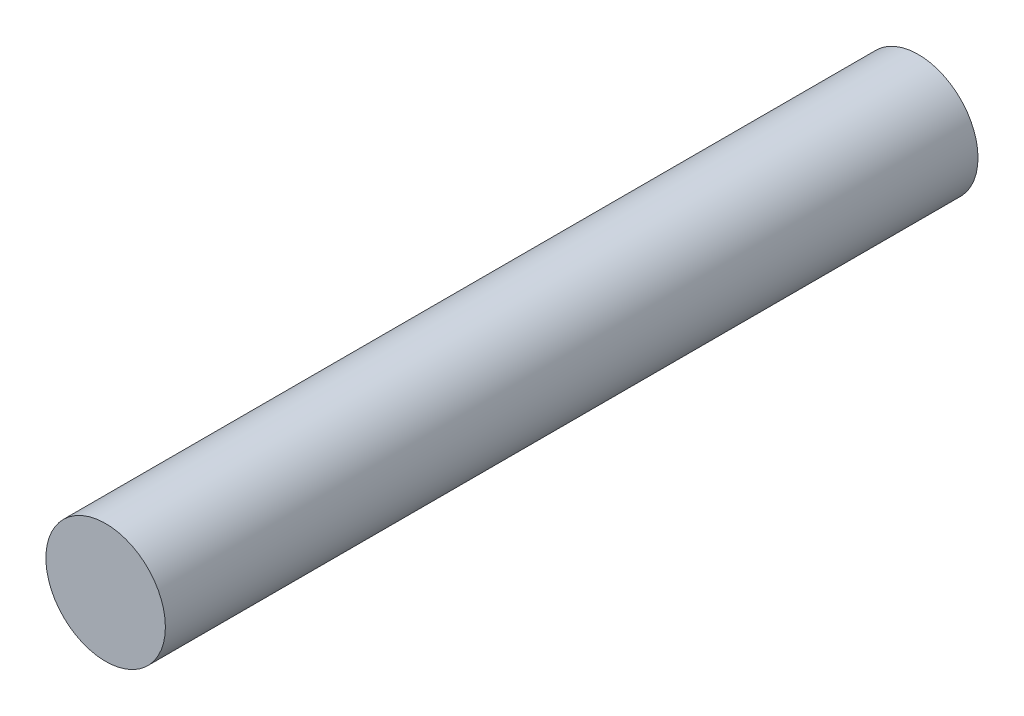
ISO-10303-21;
HEADER;
FILE_DESCRIPTION(('STEP AP214'),'2;1');
FILE_NAME('part.step','',(''),(''),'','','');
FILE_SCHEMA(('AUTOMOTIVE_DESIGN { 1 0 10303 214 1 1 1 1 }'));
ENDSEC;
DATA;
#1=APPLICATION_CONTEXT('core data for automotive mechanical design processes');
#2=APPLICATION_PROTOCOL_DEFINITION('international standard','automotive_design',2000,#1);
#3=PRODUCT_CONTEXT('',#1,'mechanical');
#4=PRODUCT('Part','Part','',(#3));
#5=PRODUCT_RELATED_PRODUCT_CATEGORY('part','',(#4));
#6=PRODUCT_DEFINITION_FORMATION('','',#4);
#7=PRODUCT_DEFINITION_CONTEXT('part definition',#1,'design');
#8=PRODUCT_DEFINITION('design','',#6,#7);
#9=PRODUCT_DEFINITION_SHAPE('','',#8);
#10=(LENGTH_UNIT() NAMED_UNIT(*) SI_UNIT(.MILLI.,.METRE.));
#11=(NAMED_UNIT(*) PLANE_ANGLE_UNIT() SI_UNIT($,.RADIAN.));
#12=(NAMED_UNIT(*) SI_UNIT($,.STERADIAN.) SOLID_ANGLE_UNIT());
#13=UNCERTAINTY_MEASURE_WITH_UNIT(LENGTH_MEASURE(1.E-05),#10,'distance_accuracy_value','');
#14=(GEOMETRIC_REPRESENTATION_CONTEXT(3) GLOBAL_UNCERTAINTY_ASSIGNED_CONTEXT((#13)) GLOBAL_UNIT_ASSIGNED_CONTEXT((#10,
#11,#12)) REPRESENTATION_CONTEXT('',''));
#15=CARTESIAN_POINT('',(0.,0.,0.));
#16=DIRECTION('',(0.,0.,1.));
#17=DIRECTION('',(1.,0.,0.));
#18=AXIS2_PLACEMENT_3D('',#15,#16,#17);
#19=CARTESIAN_POINT('',(0.,0.,17.));
#20=DIRECTION('',(0.,0.,-1.));
#21=DIRECTION('',(-1.,0.,0.));
#22=AXIS2_PLACEMENT_3D('',#19,#20,#21);
#23=CYLINDRICAL_SURFACE('',#22,1.25);
#24=CARTESIAN_POINT('',(0.,0.,17.));
#25=DIRECTION('',(0.,0.,1.));
#26=DIRECTION('',(1.,0.,0.));
#27=AXIS2_PLACEMENT_3D('',#24,#25,#26);
#28=CIRCLE('',#27,1.25);
#29=CARTESIAN_POINT('',(1.25,0.,17.));
#30=VERTEX_POINT('',#29);
#31=EDGE_CURVE('E10',#30,#30,#28,.T.);
#32=ORIENTED_EDGE('',*,*,#31,.F.);
#33=EDGE_LOOP('',(#32));
#34=FACE_BOUND('',#33,.T.);
#35=CARTESIAN_POINT('',(0.,0.,0.));
#36=DIRECTION('',(0.,0.,1.));
#37=DIRECTION('',(1.,0.,0.));
#38=AXIS2_PLACEMENT_3D('',#35,#36,#37);
#39=CIRCLE('',#38,1.25);
#40=CARTESIAN_POINT('',(1.25,0.,0.));
#41=VERTEX_POINT('',#40);
#42=EDGE_CURVE('E34',#41,#41,#39,.T.);
#43=ORIENTED_EDGE('',*,*,#42,.T.);
#44=EDGE_LOOP('',(#43));
#45=FACE_BOUND('',#44,.T.);
#46=ADVANCED_FACE('F31',(#34,#45),#23,.T.);
#47=CARTESIAN_POINT('',(0.,0.,17.));
#48=DIRECTION('',(0.,0.,1.));
#49=DIRECTION('',(1.,0.,0.));
#50=AXIS2_PLACEMENT_3D('',#47,#48,#49);
#51=PLANE('',#50);
#52=ORIENTED_EDGE('',*,*,#31,.T.);
#53=EDGE_LOOP('',(#52));
#54=FACE_BOUND('',#53,.T.);
#55=ADVANCED_FACE('F46',(#54),#51,.T.);
#56=CARTESIAN_POINT('',(0.,0.,0.));
#57=DIRECTION('',(0.,0.,1.));
#58=DIRECTION('',(1.,0.,0.));
#59=AXIS2_PLACEMENT_3D('',#56,#57,#58);
#60=PLANE('',#59);
#61=ORIENTED_EDGE('',*,*,#42,.F.);
#62=EDGE_LOOP('',(#61));
#63=FACE_BOUND('',#62,.T.);
#64=ADVANCED_FACE('F44',(#63),#60,.F.);
#65=CLOSED_SHELL('',(#46,#55,#64));
#66=MANIFOLD_SOLID_BREP('B2',#65);
#67=ADVANCED_BREP_SHAPE_REPRESENTATION('',(#18,#66),#14);
#68=SHAPE_DEFINITION_REPRESENTATION(#9,#67);
ENDSEC;
END-ISO-10303-21;
